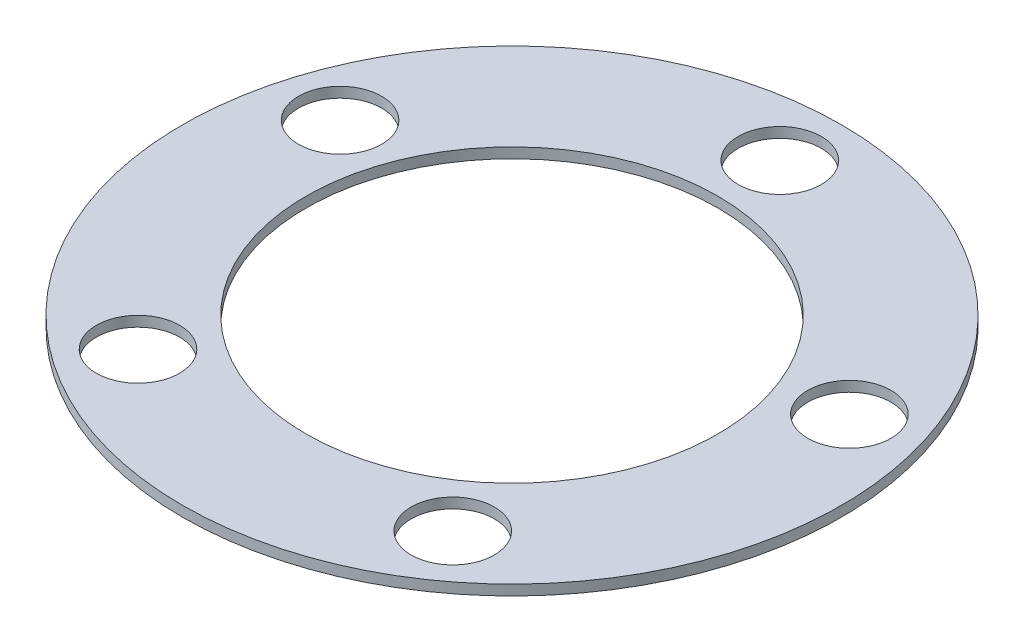
ISO-10303-21;
HEADER;
FILE_DESCRIPTION(('STEP AP214'),'2;1');
FILE_NAME('part.step','',(''),(''),'','','');
FILE_SCHEMA(('AUTOMOTIVE_DESIGN { 1 0 10303 214 1 1 1 1 }'));
ENDSEC;
DATA;
#1=APPLICATION_CONTEXT('core data for automotive mechanical design processes');
#2=APPLICATION_PROTOCOL_DEFINITION('international standard','automotive_design',2000,#1);
#3=PRODUCT_CONTEXT('',#1,'mechanical');
#4=PRODUCT('Part','Part','',(#3));
#5=PRODUCT_RELATED_PRODUCT_CATEGORY('part','',(#4));
#6=PRODUCT_DEFINITION_FORMATION('','',#4);
#7=PRODUCT_DEFINITION_CONTEXT('part definition',#1,'design');
#8=PRODUCT_DEFINITION('design','',#6,#7);
#9=PRODUCT_DEFINITION_SHAPE('','',#8);
#10=(LENGTH_UNIT() NAMED_UNIT(*) SI_UNIT(.MILLI.,.METRE.));
#11=(NAMED_UNIT(*) PLANE_ANGLE_UNIT() SI_UNIT($,.RADIAN.));
#12=(NAMED_UNIT(*) SI_UNIT($,.STERADIAN.) SOLID_ANGLE_UNIT());
#13=UNCERTAINTY_MEASURE_WITH_UNIT(LENGTH_MEASURE(1.E-05),#10,'distance_accuracy_value','');
#14=(GEOMETRIC_REPRESENTATION_CONTEXT(3) GLOBAL_UNCERTAINTY_ASSIGNED_CONTEXT((#13)) GLOBAL_UNIT_ASSIGNED_CONTEXT((#10,
#11,#12)) REPRESENTATION_CONTEXT('',''));
#15=CARTESIAN_POINT('',(0.,0.,0.));
#16=DIRECTION('',(0.,0.,1.));
#17=DIRECTION('',(1.,0.,0.));
#18=AXIS2_PLACEMENT_3D('',#15,#16,#17);
#19=CARTESIAN_POINT('',(0.,3.175,0.));
#20=DIRECTION('',(0.,-1.,0.));
#21=DIRECTION('',(0.,0.,-1.));
#22=AXIS2_PLACEMENT_3D('',#19,#20,#21);
#23=CYLINDRICAL_SURFACE('',#22,101.6);
#24=CARTESIAN_POINT('',(0.,3.175,0.));
#25=DIRECTION('',(0.,1.,0.));
#26=DIRECTION('',(0.,0.,1.));
#27=AXIS2_PLACEMENT_3D('',#24,#25,#26);
#28=CIRCLE('',#27,101.6);
#29=CARTESIAN_POINT('',(0.,3.175,101.6));
#30=VERTEX_POINT('',#29);
#31=EDGE_CURVE('E10',#30,#30,#28,.T.);
#32=ORIENTED_EDGE('',*,*,#31,.F.);
#33=EDGE_LOOP('',(#32));
#34=FACE_BOUND('',#33,.T.);
#35=CARTESIAN_POINT('',(0.,0.,0.));
#36=DIRECTION('',(0.,1.,0.));
#37=DIRECTION('',(0.,0.,1.));
#38=AXIS2_PLACEMENT_3D('',#35,#36,#37);
#39=CIRCLE('',#38,101.6);
#40=CARTESIAN_POINT('',(0.,0.,101.6));
#41=VERTEX_POINT('',#40);
#42=EDGE_CURVE('E34',#41,#41,#39,.T.);
#43=ORIENTED_EDGE('',*,*,#42,.T.);
#44=EDGE_LOOP('',(#43));
#45=FACE_BOUND('',#44,.T.);
#46=ADVANCED_FACE('F31',(#34,#45),#23,.T.);
#47=CARTESIAN_POINT('',(0.,3.175,0.));
#48=DIRECTION('',(0.,1.,0.));
#49=DIRECTION('',(0.,0.,1.));
#50=AXIS2_PLACEMENT_3D('',#47,#48,#49);
#51=PLANE('',#50);
#52=CARTESIAN_POINT('',(0.,3.175,0.));
#53=DIRECTION('',(0.,1.,0.));
#54=DIRECTION('',(0.,0.,1.));
#55=AXIS2_PLACEMENT_3D('',#52,#53,#54);
#56=CIRCLE('',#55,63.5);
#57=CARTESIAN_POINT('',(0.,3.175,63.5));
#58=VERTEX_POINT('',#57);
#59=EDGE_CURVE('E73',#58,#58,#56,.T.);
#60=ORIENTED_EDGE('',*,*,#59,.F.);
#61=EDGE_LOOP('',(#60));
#62=FACE_BOUND('',#61,.T.);
#63=CARTESIAN_POINT('',(0.,3.175,-82.55));
#64=DIRECTION('',(0.,1.,0.));
#65=DIRECTION('',(0.,0.,1.));
#66=AXIS2_PLACEMENT_3D('',#63,#64,#65);
#67=CIRCLE('',#66,12.827);
#68=CARTESIAN_POINT('',(0.,3.175,-69.723));
#69=VERTEX_POINT('',#68);
#70=EDGE_CURVE('E68',#69,#69,#67,.T.);
#71=ORIENTED_EDGE('',*,*,#70,.F.);
#72=EDGE_LOOP('',(#71));
#73=FACE_BOUND('',#72,.T.);
#74=CARTESIAN_POINT('',(78.5097154201666,3.175,-25.5093528856541));
#75=DIRECTION('',(0.,1.,0.));
#76=DIRECTION('',(0.,0.,1.));
#77=AXIS2_PLACEMENT_3D('',#74,#75,#76);
#78=CIRCLE('',#77,12.827);
#79=CARTESIAN_POINT('',(78.5097154201666,3.175,-12.6823528856541));
#80=VERTEX_POINT('',#79);
#81=EDGE_CURVE('E62',#80,#80,#78,.T.);
#82=ORIENTED_EDGE('',*,*,#81,.F.);
#83=EDGE_LOOP('',(#82));
#84=FACE_BOUND('',#83,.T.);
#85=CARTESIAN_POINT('',(48.521672576748,3.175,66.7843528856505));
#86=DIRECTION('',(0.,1.,0.));
#87=DIRECTION('',(0.,0.,1.));
#88=AXIS2_PLACEMENT_3D('',#85,#86,#87);
#89=CIRCLE('',#88,12.827);
#90=CARTESIAN_POINT('',(48.521672576748,3.175,79.6113528856505));
#91=VERTEX_POINT('',#90);
#92=EDGE_CURVE('E56',#91,#91,#89,.T.);
#93=ORIENTED_EDGE('',*,*,#92,.F.);
#94=EDGE_LOOP('',(#93));
#95=FACE_BOUND('',#94,.T.);
#96=CARTESIAN_POINT('',(-48.5216725767394,3.175,66.7843528856533));
#97=DIRECTION('',(0.,1.,0.));
#98=DIRECTION('',(0.,0.,1.));
#99=AXIS2_PLACEMENT_3D('',#96,#97,#98);
#100=CIRCLE('',#99,12.827);
#101=CARTESIAN_POINT('',(-48.5216725767394,3.175,79.6113528856533));
#102=VERTEX_POINT('',#101);
#103=EDGE_CURVE('E50',#102,#102,#100,.T.);
#104=ORIENTED_EDGE('',*,*,#103,.F.);
#105=EDGE_LOOP('',(#104));
#106=FACE_BOUND('',#105,.T.);
#107=CARTESIAN_POINT('',(-78.5097154201632,3.175,-25.5093528856497));
#108=DIRECTION('',(0.,1.,0.));
#109=DIRECTION('',(0.,0.,1.));
#110=AXIS2_PLACEMENT_3D('',#107,#108,#109);
#111=CIRCLE('',#110,12.827);
#112=CARTESIAN_POINT('',(-78.5097154201632,3.175,-12.6823528856497));
#113=VERTEX_POINT('',#112);
#114=EDGE_CURVE('E43',#113,#113,#111,.T.);
#115=ORIENTED_EDGE('',*,*,#114,.F.);
#116=EDGE_LOOP('',(#115));
#117=FACE_BOUND('',#116,.T.);
#118=ORIENTED_EDGE('',*,*,#31,.T.);
#119=EDGE_LOOP('',(#118));
#120=FACE_BOUND('',#119,.T.);
#121=ADVANCED_FACE('F89',(#62,#73,#84,#95,#106,#117,#120),#51,.T.);
#122=CARTESIAN_POINT('',(0.,0.,0.));
#123=DIRECTION('',(0.,1.,0.));
#124=DIRECTION('',(0.,0.,1.));
#125=AXIS2_PLACEMENT_3D('',#122,#123,#124);
#126=PLANE('',#125);
#127=CARTESIAN_POINT('',(0.,0.,0.));
#128=DIRECTION('',(0.,1.,0.));
#129=DIRECTION('',(0.,0.,1.));
#130=AXIS2_PLACEMENT_3D('',#127,#128,#129);
#131=CIRCLE('',#130,63.5);
#132=CARTESIAN_POINT('',(0.,0.,63.5));
#133=VERTEX_POINT('',#132);
#134=EDGE_CURVE('E47',#133,#133,#131,.T.);
#135=ORIENTED_EDGE('',*,*,#134,.T.);
#136=EDGE_LOOP('',(#135));
#137=FACE_BOUND('',#136,.T.);
#138=CARTESIAN_POINT('',(0.,0.,-82.55));
#139=DIRECTION('',(0.,1.,0.));
#140=DIRECTION('',(0.,0.,1.));
#141=AXIS2_PLACEMENT_3D('',#138,#139,#140);
#142=CIRCLE('',#141,12.827);
#143=CARTESIAN_POINT('',(0.,0.,-69.723));
#144=VERTEX_POINT('',#143);
#145=EDGE_CURVE('E41',#144,#144,#142,.T.);
#146=ORIENTED_EDGE('',*,*,#145,.T.);
#147=EDGE_LOOP('',(#146));
#148=FACE_BOUND('',#147,.T.);
#149=CARTESIAN_POINT('',(78.5097154201666,0.,-25.5093528856541));
#150=DIRECTION('',(0.,1.,0.));
#151=DIRECTION('',(0.,0.,1.));
#152=AXIS2_PLACEMENT_3D('',#149,#150,#151);
#153=CIRCLE('',#152,12.827);
#154=CARTESIAN_POINT('',(78.5097154201666,0.,-12.6823528856541));
#155=VERTEX_POINT('',#154);
#156=EDGE_CURVE('E65',#155,#155,#153,.T.);
#157=ORIENTED_EDGE('',*,*,#156,.T.);
#158=EDGE_LOOP('',(#157));
#159=FACE_BOUND('',#158,.T.);
#160=CARTESIAN_POINT('',(48.521672576748,0.,66.7843528856505));
#161=DIRECTION('',(0.,1.,0.));
#162=DIRECTION('',(0.,0.,1.));
#163=AXIS2_PLACEMENT_3D('',#160,#161,#162);
#164=CIRCLE('',#163,12.827);
#165=CARTESIAN_POINT('',(48.521672576748,0.,79.6113528856505));
#166=VERTEX_POINT('',#165);
#167=EDGE_CURVE('E59',#166,#166,#164,.T.);
#168=ORIENTED_EDGE('',*,*,#167,.T.);
#169=EDGE_LOOP('',(#168));
#170=FACE_BOUND('',#169,.T.);
#171=CARTESIAN_POINT('',(-48.5216725767394,0.,66.7843528856533));
#172=DIRECTION('',(0.,1.,0.));
#173=DIRECTION('',(0.,0.,1.));
#174=AXIS2_PLACEMENT_3D('',#171,#172,#173);
#175=CIRCLE('',#174,12.827);
#176=CARTESIAN_POINT('',(-48.5216725767394,0.,79.6113528856533));
#177=VERTEX_POINT('',#176);
#178=EDGE_CURVE('E53',#177,#177,#175,.T.);
#179=ORIENTED_EDGE('',*,*,#178,.T.);
#180=EDGE_LOOP('',(#179));
#181=FACE_BOUND('',#180,.T.);
#182=CARTESIAN_POINT('',(-78.5097154201632,0.,-25.5093528856497));
#183=DIRECTION('',(0.,1.,0.));
#184=DIRECTION('',(0.,0.,1.));
#185=AXIS2_PLACEMENT_3D('',#182,#183,#184);
#186=CIRCLE('',#185,12.827);
#187=CARTESIAN_POINT('',(-78.5097154201632,0.,-12.6823528856497));
#188=VERTEX_POINT('',#187);
#189=EDGE_CURVE('E46',#188,#188,#186,.T.);
#190=ORIENTED_EDGE('',*,*,#189,.T.);
#191=EDGE_LOOP('',(#190));
#192=FACE_BOUND('',#191,.T.);
#193=ORIENTED_EDGE('',*,*,#42,.F.);
#194=EDGE_LOOP('',(#193));
#195=FACE_BOUND('',#194,.T.);
#196=ADVANCED_FACE('F79',(#137,#148,#159,#170,#181,#192,#195),#126,.F.);
#197=CARTESIAN_POINT('',(-78.5097154201632,0.,-25.5093528856497));
#198=DIRECTION('',(0.,1.,0.));
#199=DIRECTION('',(0.,0.,1.));
#200=AXIS2_PLACEMENT_3D('',#197,#198,#199);
#201=CYLINDRICAL_SURFACE('',#200,12.827);
#202=ORIENTED_EDGE('',*,*,#189,.F.);
#203=EDGE_LOOP('',(#202));
#204=FACE_BOUND('',#203,.T.);
#205=ORIENTED_EDGE('',*,*,#114,.T.);
#206=EDGE_LOOP('',(#205));
#207=FACE_BOUND('',#206,.T.);
#208=ADVANCED_FACE('F103',(#204,#207),#201,.F.);
#209=CARTESIAN_POINT('',(-48.5216725767394,0.,66.7843528856533));
#210=DIRECTION('',(0.,1.,0.));
#211=DIRECTION('',(0.,0.,1.));
#212=AXIS2_PLACEMENT_3D('',#209,#210,#211);
#213=CYLINDRICAL_SURFACE('',#212,12.827);
#214=ORIENTED_EDGE('',*,*,#178,.F.);
#215=EDGE_LOOP('',(#214));
#216=FACE_BOUND('',#215,.T.);
#217=ORIENTED_EDGE('',*,*,#103,.T.);
#218=EDGE_LOOP('',(#217));
#219=FACE_BOUND('',#218,.T.);
#220=ADVANCED_FACE('F105',(#216,#219),#213,.F.);
#221=CARTESIAN_POINT('',(48.521672576748,0.,66.7843528856505));
#222=DIRECTION('',(0.,1.,0.));
#223=DIRECTION('',(0.,0.,1.));
#224=AXIS2_PLACEMENT_3D('',#221,#222,#223);
#225=CYLINDRICAL_SURFACE('',#224,12.827);
#226=ORIENTED_EDGE('',*,*,#167,.F.);
#227=EDGE_LOOP('',(#226));
#228=FACE_BOUND('',#227,.T.);
#229=ORIENTED_EDGE('',*,*,#92,.T.);
#230=EDGE_LOOP('',(#229));
#231=FACE_BOUND('',#230,.T.);
#232=ADVANCED_FACE('F112',(#228,#231),#225,.F.);
#233=CARTESIAN_POINT('',(78.5097154201666,0.,-25.5093528856541));
#234=DIRECTION('',(0.,1.,0.));
#235=DIRECTION('',(0.,0.,1.));
#236=AXIS2_PLACEMENT_3D('',#233,#234,#235);
#237=CYLINDRICAL_SURFACE('',#236,12.827);
#238=ORIENTED_EDGE('',*,*,#156,.F.);
#239=EDGE_LOOP('',(#238));
#240=FACE_BOUND('',#239,.T.);
#241=ORIENTED_EDGE('',*,*,#81,.T.);
#242=EDGE_LOOP('',(#241));
#243=FACE_BOUND('',#242,.T.);
#244=ADVANCED_FACE('F149',(#240,#243),#237,.F.);
#245=CARTESIAN_POINT('',(0.,0.,-82.55));
#246=DIRECTION('',(0.,1.,0.));
#247=DIRECTION('',(0.,0.,1.));
#248=AXIS2_PLACEMENT_3D('',#245,#246,#247);
#249=CYLINDRICAL_SURFACE('',#248,12.827);
#250=ORIENTED_EDGE('',*,*,#145,.F.);
#251=EDGE_LOOP('',(#250));
#252=FACE_BOUND('',#251,.T.);
#253=ORIENTED_EDGE('',*,*,#70,.T.);
#254=EDGE_LOOP('',(#253));
#255=FACE_BOUND('',#254,.T.);
#256=ADVANCED_FACE('F85',(#252,#255),#249,.F.);
#257=CARTESIAN_POINT('',(0.,0.,0.));
#258=DIRECTION('',(0.,1.,0.));
#259=DIRECTION('',(0.,0.,1.));
#260=AXIS2_PLACEMENT_3D('',#257,#258,#259);
#261=CYLINDRICAL_SURFACE('',#260,63.5);
#262=ORIENTED_EDGE('',*,*,#134,.F.);
#263=EDGE_LOOP('',(#262));
#264=FACE_BOUND('',#263,.T.);
#265=ORIENTED_EDGE('',*,*,#59,.T.);
#266=EDGE_LOOP('',(#265));
#267=FACE_BOUND('',#266,.T.);
#268=ADVANCED_FACE('F82',(#264,#267),#261,.F.);
#269=CLOSED_SHELL('',(#46,#121,#196,#208,#220,#232,#244,#256,#268));
#270=MANIFOLD_SOLID_BREP('B2',#269);
#271=ADVANCED_BREP_SHAPE_REPRESENTATION('',(#18,#270),#14);
#272=SHAPE_DEFINITION_REPRESENTATION(#9,#271);
ENDSEC;
END-ISO-10303-21;
